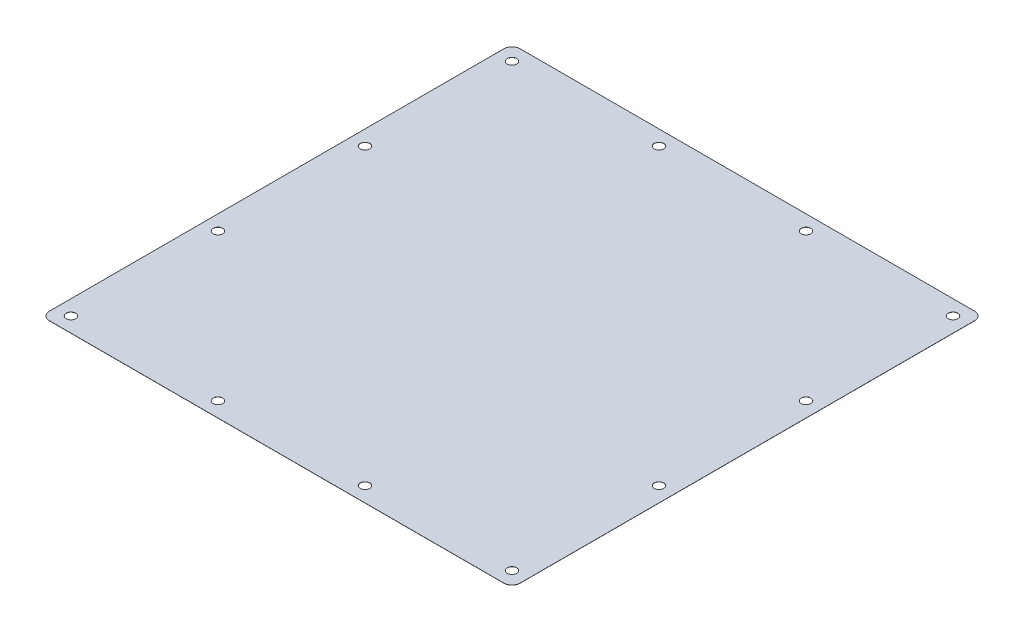
ISO-10303-21;
HEADER;
FILE_DESCRIPTION(('STEP AP214'),'2;1');
FILE_NAME('part.step','',(''),(''),'','','');
FILE_SCHEMA(('AUTOMOTIVE_DESIGN { 1 0 10303 214 1 1 1 1 }'));
ENDSEC;
DATA;
#1=APPLICATION_CONTEXT('core data for automotive mechanical design processes');
#2=APPLICATION_PROTOCOL_DEFINITION('international standard','automotive_design',2000,#1);
#3=PRODUCT_CONTEXT('',#1,'mechanical');
#4=PRODUCT('Part','Part','',(#3));
#5=PRODUCT_RELATED_PRODUCT_CATEGORY('part','',(#4));
#6=PRODUCT_DEFINITION_FORMATION('','',#4);
#7=PRODUCT_DEFINITION_CONTEXT('part definition',#1,'design');
#8=PRODUCT_DEFINITION('design','',#6,#7);
#9=PRODUCT_DEFINITION_SHAPE('','',#8);
#10=(LENGTH_UNIT() NAMED_UNIT(*) SI_UNIT(.MILLI.,.METRE.));
#11=(NAMED_UNIT(*) PLANE_ANGLE_UNIT() SI_UNIT($,.RADIAN.));
#12=(NAMED_UNIT(*) SI_UNIT($,.STERADIAN.) SOLID_ANGLE_UNIT());
#13=UNCERTAINTY_MEASURE_WITH_UNIT(LENGTH_MEASURE(1.E-05),#10,'distance_accuracy_value','');
#14=(GEOMETRIC_REPRESENTATION_CONTEXT(3) GLOBAL_UNCERTAINTY_ASSIGNED_CONTEXT((#13)) GLOBAL_UNIT_ASSIGNED_CONTEXT((#10,
#11,#12)) REPRESENTATION_CONTEXT('',''));
#15=CARTESIAN_POINT('',(0.,0.,0.));
#16=DIRECTION('',(0.,0.,1.));
#17=DIRECTION('',(1.,0.,0.));
#18=AXIS2_PLACEMENT_3D('',#15,#16,#17);
#19=CARTESIAN_POINT('',(177.038,-0.0508,-3.175));
#20=DIRECTION('',(0.,1.,0.));
#21=DIRECTION('',(0.,0.,1.));
#22=AXIS2_PLACEMENT_3D('',#19,#20,#21);
#23=CYLINDRICAL_SURFACE('',#22,3.17500000000001);
#24=CARTESIAN_POINT('',(177.038,0.,-3.175));
#25=DIRECTION('',(0.,1.,0.));
#26=DIRECTION('',(0.,0.,-1.));
#27=AXIS2_PLACEMENT_3D('',#24,#25,#26);
#28=CIRCLE('',#27,3.17500000000001);
#29=CARTESIAN_POINT('',(177.038,0.,0.));
#30=VERTEX_POINT('',#29);
#31=CARTESIAN_POINT('',(180.213,0.,-3.175));
#32=VERTEX_POINT('',#31);
#33=EDGE_CURVE('E138',#30,#32,#28,.T.);
#34=ORIENTED_EDGE('',*,*,#33,.F.);
#35=DIRECTION('',(0.,1.,0.));
#36=VECTOR('',#35,1.);
#37=CARTESIAN_POINT('',(177.038,-0.0508,0.));
#38=LINE('',#37,#36);
#39=CARTESIAN_POINT('',(177.038,-0.0508,0.));
#40=VERTEX_POINT('',#39);
#41=EDGE_CURVE('E11',#40,#30,#38,.T.);
#42=ORIENTED_EDGE('',*,*,#41,.F.);
#43=CARTESIAN_POINT('',(177.038,-0.0508,-3.175));
#44=DIRECTION('',(0.,1.,0.));
#45=DIRECTION('',(0.,0.,-1.));
#46=AXIS2_PLACEMENT_3D('',#43,#44,#45);
#47=CIRCLE('',#46,3.17500000000001);
#48=CARTESIAN_POINT('',(180.213,-0.0508,-3.175));
#49=VERTEX_POINT('',#48);
#50=EDGE_CURVE('E159',#40,#49,#47,.T.);
#51=ORIENTED_EDGE('',*,*,#50,.T.);
#52=DIRECTION('',(0.,1.,0.));
#53=VECTOR('',#52,1.);
#54=CARTESIAN_POINT('',(180.213,-0.0508,-3.175));
#55=LINE('',#54,#53);
#56=EDGE_CURVE('E44',#49,#32,#55,.T.);
#57=ORIENTED_EDGE('',*,*,#56,.T.);
#58=EDGE_LOOP('',(#34,#42,#51,#57));
#59=FACE_BOUND('',#58,.T.);
#60=ADVANCED_FACE('F41',(#59),#23,.T.);
#61=CARTESIAN_POINT('',(3.17500000000002,-0.0508,0.));
#62=DIRECTION('',(0.,0.,1.));
#63=DIRECTION('',(1.,0.,0.));
#64=AXIS2_PLACEMENT_3D('',#61,#62,#63);
#65=PLANE('',#64);
#66=DIRECTION('',(1.,0.,0.));
#67=VECTOR('',#66,1.);
#68=CARTESIAN_POINT('',(3.17500000000002,0.,0.));
#69=LINE('',#68,#67);
#70=CARTESIAN_POINT('',(3.17500000000002,0.,0.));
#71=VERTEX_POINT('',#70);
#72=EDGE_CURVE('E157',#71,#30,#69,.T.);
#73=ORIENTED_EDGE('',*,*,#72,.F.);
#74=DIRECTION('',(0.,1.,0.));
#75=VECTOR('',#74,1.);
#76=CARTESIAN_POINT('',(3.17500000000002,-0.0508,0.));
#77=LINE('',#76,#75);
#78=CARTESIAN_POINT('',(3.17500000000002,-0.0508,0.));
#79=VERTEX_POINT('',#78);
#80=EDGE_CURVE('E50',#79,#71,#77,.T.);
#81=ORIENTED_EDGE('',*,*,#80,.F.);
#82=DIRECTION('',(1.,0.,0.));
#83=VECTOR('',#82,1.);
#84=CARTESIAN_POINT('',(3.17500000000002,-0.0508,0.));
#85=LINE('',#84,#83);
#86=EDGE_CURVE('E128',#79,#40,#85,.T.);
#87=ORIENTED_EDGE('',*,*,#86,.T.);
#88=ORIENTED_EDGE('',*,*,#41,.T.);
#89=EDGE_LOOP('',(#73,#81,#87,#88));
#90=FACE_BOUND('',#89,.T.);
#91=ADVANCED_FACE('F171',(#90),#65,.T.);
#92=CARTESIAN_POINT('',(3.175,-0.0508,-3.175));
#93=DIRECTION('',(0.,1.,0.));
#94=DIRECTION('',(0.,0.,1.));
#95=AXIS2_PLACEMENT_3D('',#92,#93,#94);
#96=CYLINDRICAL_SURFACE('',#95,3.175);
#97=CARTESIAN_POINT('',(3.175,0.,-3.175));
#98=DIRECTION('',(0.,1.,0.));
#99=DIRECTION('',(0.,0.,-1.));
#100=AXIS2_PLACEMENT_3D('',#97,#98,#99);
#101=CIRCLE('',#100,3.175);
#102=CARTESIAN_POINT('',(0.,0.,-3.17500000000002));
#103=VERTEX_POINT('',#102);
#104=EDGE_CURVE('E115',#103,#71,#101,.T.);
#105=ORIENTED_EDGE('',*,*,#104,.F.);
#106=DIRECTION('',(0.,1.,0.));
#107=VECTOR('',#106,1.);
#108=CARTESIAN_POINT('',(0.,-0.0508,-3.17500000000002));
#109=LINE('',#108,#107);
#110=CARTESIAN_POINT('',(0.,-0.0508,-3.17500000000002));
#111=VERTEX_POINT('',#110);
#112=EDGE_CURVE('E110',#111,#103,#109,.T.);
#113=ORIENTED_EDGE('',*,*,#112,.F.);
#114=CARTESIAN_POINT('',(3.175,-0.0508,-3.175));
#115=DIRECTION('',(0.,1.,0.));
#116=DIRECTION('',(0.,0.,-1.));
#117=AXIS2_PLACEMENT_3D('',#114,#115,#116);
#118=CIRCLE('',#117,3.175);
#119=EDGE_CURVE('E113',#111,#79,#118,.T.);
#120=ORIENTED_EDGE('',*,*,#119,.T.);
#121=ORIENTED_EDGE('',*,*,#80,.T.);
#122=EDGE_LOOP('',(#105,#113,#120,#121));
#123=FACE_BOUND('',#122,.T.);
#124=ADVANCED_FACE('F112',(#123),#96,.T.);
#125=CARTESIAN_POINT('',(0.,-0.0508,-3.17500000000002));
#126=DIRECTION('',(-1.,0.,0.));
#127=DIRECTION('',(0.,0.,1.));
#128=AXIS2_PLACEMENT_3D('',#125,#126,#127);
#129=PLANE('',#128);
#130=DIRECTION('',(0.,0.,1.));
#131=VECTOR('',#130,1.);
#132=CARTESIAN_POINT('',(0.,0.,-3.17500000000002));
#133=LINE('',#132,#131);
#134=CARTESIAN_POINT('',(0.,0.,-177.038));
#135=VERTEX_POINT('',#134);
#136=EDGE_CURVE('E154',#135,#103,#133,.T.);
#137=ORIENTED_EDGE('',*,*,#136,.F.);
#138=DIRECTION('',(0.,1.,0.));
#139=VECTOR('',#138,1.);
#140=CARTESIAN_POINT('',(0.,-0.0508,-177.038));
#141=LINE('',#140,#139);
#142=CARTESIAN_POINT('',(0.,-0.0508,-177.038));
#143=VERTEX_POINT('',#142);
#144=EDGE_CURVE('E120',#143,#135,#141,.T.);
#145=ORIENTED_EDGE('',*,*,#144,.F.);
#146=DIRECTION('',(0.,0.,1.));
#147=VECTOR('',#146,1.);
#148=CARTESIAN_POINT('',(0.,-0.0508,-3.17500000000002));
#149=LINE('',#148,#147);
#150=EDGE_CURVE('E126',#143,#111,#149,.T.);
#151=ORIENTED_EDGE('',*,*,#150,.T.);
#152=ORIENTED_EDGE('',*,*,#112,.T.);
#153=EDGE_LOOP('',(#137,#145,#151,#152));
#154=FACE_BOUND('',#153,.T.);
#155=ADVANCED_FACE('F130',(#154),#129,.T.);
#156=CARTESIAN_POINT('',(3.175,-0.0508,-177.038));
#157=DIRECTION('',(0.,1.,0.));
#158=DIRECTION('',(0.,0.,1.));
#159=AXIS2_PLACEMENT_3D('',#156,#157,#158);
#160=CYLINDRICAL_SURFACE('',#159,3.17500000000001);
#161=CARTESIAN_POINT('',(3.175,0.,-177.038));
#162=DIRECTION('',(0.,1.,0.));
#163=DIRECTION('',(0.,0.,1.));
#164=AXIS2_PLACEMENT_3D('',#161,#162,#163);
#165=CIRCLE('',#164,3.17500000000001);
#166=CARTESIAN_POINT('',(3.175,0.,-180.213));
#167=VERTEX_POINT('',#166);
#168=EDGE_CURVE('E151',#167,#135,#165,.T.);
#169=ORIENTED_EDGE('',*,*,#168,.F.);
#170=DIRECTION('',(0.,1.,0.));
#171=VECTOR('',#170,1.);
#172=CARTESIAN_POINT('',(3.175,-0.0508,-180.213));
#173=LINE('',#172,#171);
#174=CARTESIAN_POINT('',(3.175,-0.0508,-180.213));
#175=VERTEX_POINT('',#174);
#176=EDGE_CURVE('E163',#175,#167,#173,.T.);
#177=ORIENTED_EDGE('',*,*,#176,.F.);
#178=CARTESIAN_POINT('',(3.175,-0.0508,-177.038));
#179=DIRECTION('',(0.,1.,0.));
#180=DIRECTION('',(0.,0.,1.));
#181=AXIS2_PLACEMENT_3D('',#178,#179,#180);
#182=CIRCLE('',#181,3.17500000000001);
#183=EDGE_CURVE('E131',#175,#143,#182,.T.);
#184=ORIENTED_EDGE('',*,*,#183,.T.);
#185=ORIENTED_EDGE('',*,*,#144,.T.);
#186=EDGE_LOOP('',(#169,#177,#184,#185));
#187=FACE_BOUND('',#186,.T.);
#188=ADVANCED_FACE('F184',(#187),#160,.T.);
#189=CARTESIAN_POINT('',(3.175,-0.0508,-180.213));
#190=DIRECTION('',(0.,0.,-1.));
#191=DIRECTION('',(-1.,0.,0.));
#192=AXIS2_PLACEMENT_3D('',#189,#190,#191);
#193=PLANE('',#192);
#194=DIRECTION('',(-1.,0.,0.));
#195=VECTOR('',#194,1.);
#196=CARTESIAN_POINT('',(3.175,0.,-180.213));
#197=LINE('',#196,#195);
#198=CARTESIAN_POINT('',(177.038,0.,-180.213));
#199=VERTEX_POINT('',#198);
#200=EDGE_CURVE('E148',#199,#167,#197,.T.);
#201=ORIENTED_EDGE('',*,*,#200,.F.);
#202=DIRECTION('',(0.,1.,0.));
#203=VECTOR('',#202,1.);
#204=CARTESIAN_POINT('',(177.038,-0.0508,-180.213));
#205=LINE('',#204,#203);
#206=CARTESIAN_POINT('',(177.038,-0.0508,-180.213));
#207=VERTEX_POINT('',#206);
#208=EDGE_CURVE('E165',#207,#199,#205,.T.);
#209=ORIENTED_EDGE('',*,*,#208,.F.);
#210=DIRECTION('',(-1.,0.,0.));
#211=VECTOR('',#210,1.);
#212=CARTESIAN_POINT('',(3.175,-0.0508,-180.213));
#213=LINE('',#212,#211);
#214=EDGE_CURVE('E133',#207,#175,#213,.T.);
#215=ORIENTED_EDGE('',*,*,#214,.T.);
#216=ORIENTED_EDGE('',*,*,#176,.T.);
#217=EDGE_LOOP('',(#201,#209,#215,#216));
#218=FACE_BOUND('',#217,.T.);
#219=ADVANCED_FACE('F187',(#218),#193,.T.);
#220=CARTESIAN_POINT('',(177.038,-0.0508,-177.038));
#221=DIRECTION('',(0.,1.,0.));
#222=DIRECTION('',(0.,0.,1.));
#223=AXIS2_PLACEMENT_3D('',#220,#221,#222);
#224=CYLINDRICAL_SURFACE('',#223,3.17500000000001);
#225=CARTESIAN_POINT('',(177.038,0.,-177.038));
#226=DIRECTION('',(0.,1.,0.));
#227=DIRECTION('',(0.,0.,1.));
#228=AXIS2_PLACEMENT_3D('',#225,#226,#227);
#229=CIRCLE('',#228,3.17500000000001);
#230=CARTESIAN_POINT('',(180.213,0.,-177.038));
#231=VERTEX_POINT('',#230);
#232=EDGE_CURVE('E145',#231,#199,#229,.T.);
#233=ORIENTED_EDGE('',*,*,#232,.F.);
#234=DIRECTION('',(0.,1.,0.));
#235=VECTOR('',#234,1.);
#236=CARTESIAN_POINT('',(180.213,-0.0508,-177.038));
#237=LINE('',#236,#235);
#238=CARTESIAN_POINT('',(180.213,-0.0508,-177.038));
#239=VERTEX_POINT('',#238);
#240=EDGE_CURVE('E166',#239,#231,#237,.T.);
#241=ORIENTED_EDGE('',*,*,#240,.F.);
#242=CARTESIAN_POINT('',(177.038,-0.0508,-177.038));
#243=DIRECTION('',(0.,1.,0.));
#244=DIRECTION('',(0.,0.,1.));
#245=AXIS2_PLACEMENT_3D('',#242,#243,#244);
#246=CIRCLE('',#245,3.17500000000001);
#247=EDGE_CURVE('E333',#239,#207,#246,.T.);
#248=ORIENTED_EDGE('',*,*,#247,.T.);
#249=ORIENTED_EDGE('',*,*,#208,.T.);
#250=EDGE_LOOP('',(#233,#241,#248,#249));
#251=FACE_BOUND('',#250,.T.);
#252=ADVANCED_FACE('F191',(#251),#224,.T.);
#253=CARTESIAN_POINT('',(180.213,-0.0508,-3.175));
#254=DIRECTION('',(1.,0.,0.));
#255=DIRECTION('',(0.,0.,-1.));
#256=AXIS2_PLACEMENT_3D('',#253,#254,#255);
#257=PLANE('',#256);
#258=DIRECTION('',(0.,0.,-1.));
#259=VECTOR('',#258,1.);
#260=CARTESIAN_POINT('',(180.213,0.,-3.175));
#261=LINE('',#260,#259);
#262=EDGE_CURVE('E141',#32,#231,#261,.T.);
#263=ORIENTED_EDGE('',*,*,#262,.F.);
#264=ORIENTED_EDGE('',*,*,#56,.F.);
#265=DIRECTION('',(0.,0.,-1.));
#266=VECTOR('',#265,1.);
#267=CARTESIAN_POINT('',(180.213,-0.0508,-3.175));
#268=LINE('',#267,#266);
#269=EDGE_CURVE('E331',#49,#239,#268,.T.);
#270=ORIENTED_EDGE('',*,*,#269,.T.);
#271=ORIENTED_EDGE('',*,*,#240,.T.);
#272=EDGE_LOOP('',(#263,#264,#270,#271));
#273=FACE_BOUND('',#272,.T.);
#274=ADVANCED_FACE('F168',(#273),#257,.T.);
#275=CARTESIAN_POINT('',(177.038,-0.0508,-3.175));
#276=DIRECTION('',(0.,-1.,0.));
#277=DIRECTION('',(0.,0.,-1.));
#278=AXIS2_PLACEMENT_3D('',#275,#276,#277);
#279=PLANE('',#278);
#280=CARTESIAN_POINT('',(118.237,-0.0507999999999997,-5.71500000000005));
#281=DIRECTION('',(0.,1.,0.));
#282=DIRECTION('',(0.,0.,1.));
#283=AXIS2_PLACEMENT_3D('',#280,#281,#282);
#284=CIRCLE('',#283,1.82880000000001);
#285=CARTESIAN_POINT('',(118.237,-0.0507999999999997,-3.88620000000004));
#286=VERTEX_POINT('',#285);
#287=EDGE_CURVE('E258',#286,#286,#284,.T.);
#288=ORIENTED_EDGE('',*,*,#287,.T.);
#289=EDGE_LOOP('',(#288));
#290=FACE_BOUND('',#289,.T.);
#291=CARTESIAN_POINT('',(174.498,-0.0507999999999997,-5.71500000000005));
#292=DIRECTION('',(0.,1.,0.));
#293=DIRECTION('',(0.,0.,1.));
#294=AXIS2_PLACEMENT_3D('',#291,#292,#293);
#295=CIRCLE('',#294,1.82879999999999);
#296=CARTESIAN_POINT('',(174.498,-0.0507999999999997,-3.88620000000006));
#297=VERTEX_POINT('',#296);
#298=EDGE_CURVE('E268',#297,#297,#295,.T.);
#299=ORIENTED_EDGE('',*,*,#298,.T.);
#300=EDGE_LOOP('',(#299));
#301=FACE_BOUND('',#300,.T.);
#302=CARTESIAN_POINT('',(174.498,-0.0507999999999997,-61.976));
#303=DIRECTION('',(0.,1.,0.));
#304=DIRECTION('',(0.,0.,1.));
#305=AXIS2_PLACEMENT_3D('',#302,#303,#304);
#306=CIRCLE('',#305,1.82879999999999);
#307=CARTESIAN_POINT('',(174.498,-0.0507999999999997,-60.1472000000001));
#308=VERTEX_POINT('',#307);
#309=EDGE_CURVE('E274',#308,#308,#306,.T.);
#310=ORIENTED_EDGE('',*,*,#309,.T.);
#311=EDGE_LOOP('',(#310));
#312=FACE_BOUND('',#311,.T.);
#313=CARTESIAN_POINT('',(174.498,-0.0507999999999997,-118.237));
#314=DIRECTION('',(0.,1.,0.));
#315=DIRECTION('',(0.,0.,1.));
#316=AXIS2_PLACEMENT_3D('',#313,#314,#315);
#317=CIRCLE('',#316,1.82879999999999);
#318=CARTESIAN_POINT('',(174.498,-0.0507999999999997,-116.4082));
#319=VERTEX_POINT('',#318);
#320=EDGE_CURVE('E280',#319,#319,#317,.T.);
#321=ORIENTED_EDGE('',*,*,#320,.T.);
#322=EDGE_LOOP('',(#321));
#323=FACE_BOUND('',#322,.T.);
#324=CARTESIAN_POINT('',(174.498,-0.0507999999999997,-174.498));
#325=DIRECTION('',(0.,1.,0.));
#326=DIRECTION('',(0.,0.,1.));
#327=AXIS2_PLACEMENT_3D('',#324,#325,#326);
#328=CIRCLE('',#327,1.82879999999999);
#329=CARTESIAN_POINT('',(174.498,-0.0507999999999997,-172.6692));
#330=VERTEX_POINT('',#329);
#331=EDGE_CURVE('E286',#330,#330,#328,.T.);
#332=ORIENTED_EDGE('',*,*,#331,.T.);
#333=EDGE_LOOP('',(#332));
#334=FACE_BOUND('',#333,.T.);
#335=CARTESIAN_POINT('',(118.237,-0.0507999999999997,-174.498));
#336=DIRECTION('',(0.,1.,0.));
#337=DIRECTION('',(0.,0.,1.));
#338=AXIS2_PLACEMENT_3D('',#335,#336,#337);
#339=CIRCLE('',#338,1.82880000000001);
#340=CARTESIAN_POINT('',(118.237,-0.0507999999999997,-172.6692));
#341=VERTEX_POINT('',#340);
#342=EDGE_CURVE('E292',#341,#341,#339,.T.);
#343=ORIENTED_EDGE('',*,*,#342,.T.);
#344=EDGE_LOOP('',(#343));
#345=FACE_BOUND('',#344,.T.);
#346=CARTESIAN_POINT('',(61.976,-0.0507999999999997,-174.498));
#347=DIRECTION('',(0.,1.,0.));
#348=DIRECTION('',(0.,0.,1.));
#349=AXIS2_PLACEMENT_3D('',#346,#347,#348);
#350=CIRCLE('',#349,1.82880000000001);
#351=CARTESIAN_POINT('',(61.976,-0.0507999999999997,-172.6692));
#352=VERTEX_POINT('',#351);
#353=EDGE_CURVE('E298',#352,#352,#350,.T.);
#354=ORIENTED_EDGE('',*,*,#353,.T.);
#355=EDGE_LOOP('',(#354));
#356=FACE_BOUND('',#355,.T.);
#357=CARTESIAN_POINT('',(5.715,-0.0507999999999997,-174.498));
#358=DIRECTION('',(0.,1.,0.));
#359=DIRECTION('',(0.,0.,1.));
#360=AXIS2_PLACEMENT_3D('',#357,#358,#359);
#361=CIRCLE('',#360,1.8288);
#362=CARTESIAN_POINT('',(5.715,-0.0507999999999997,-172.6692));
#363=VERTEX_POINT('',#362);
#364=EDGE_CURVE('E304',#363,#363,#361,.T.);
#365=ORIENTED_EDGE('',*,*,#364,.T.);
#366=EDGE_LOOP('',(#365));
#367=FACE_BOUND('',#366,.T.);
#368=CARTESIAN_POINT('',(5.715,-0.0507999999999997,-118.237));
#369=DIRECTION('',(0.,1.,0.));
#370=DIRECTION('',(0.,0.,1.));
#371=AXIS2_PLACEMENT_3D('',#368,#369,#370);
#372=CIRCLE('',#371,1.8288);
#373=CARTESIAN_POINT('',(5.715,-0.0507999999999997,-116.4082));
#374=VERTEX_POINT('',#373);
#375=EDGE_CURVE('E310',#374,#374,#372,.T.);
#376=ORIENTED_EDGE('',*,*,#375,.T.);
#377=EDGE_LOOP('',(#376));
#378=FACE_BOUND('',#377,.T.);
#379=CARTESIAN_POINT('',(5.715,-0.0507999999999997,-61.976));
#380=DIRECTION('',(0.,1.,0.));
#381=DIRECTION('',(0.,0.,1.));
#382=AXIS2_PLACEMENT_3D('',#379,#380,#381);
#383=CIRCLE('',#382,1.8288);
#384=CARTESIAN_POINT('',(5.715,-0.0507999999999997,-60.1472));
#385=VERTEX_POINT('',#384);
#386=EDGE_CURVE('E316',#385,#385,#383,.T.);
#387=ORIENTED_EDGE('',*,*,#386,.T.);
#388=EDGE_LOOP('',(#387));
#389=FACE_BOUND('',#388,.T.);
#390=CARTESIAN_POINT('',(5.715,-0.0507999999999997,-5.71500000000005));
#391=DIRECTION('',(0.,1.,0.));
#392=DIRECTION('',(0.,0.,1.));
#393=AXIS2_PLACEMENT_3D('',#390,#391,#392);
#394=CIRCLE('',#393,1.8288);
#395=CARTESIAN_POINT('',(5.715,-0.0507999999999997,-3.88620000000006));
#396=VERTEX_POINT('',#395);
#397=EDGE_CURVE('E322',#396,#396,#394,.T.);
#398=ORIENTED_EDGE('',*,*,#397,.T.);
#399=EDGE_LOOP('',(#398));
#400=FACE_BOUND('',#399,.T.);
#401=CARTESIAN_POINT('',(61.976,-0.0507999999999997,-5.71500000000005));
#402=DIRECTION('',(0.,1.,0.));
#403=DIRECTION('',(0.,0.,1.));
#404=AXIS2_PLACEMENT_3D('',#401,#402,#403);
#405=CIRCLE('',#404,1.82880000000001);
#406=CARTESIAN_POINT('',(61.976,-0.0507999999999997,-3.88620000000004));
#407=VERTEX_POINT('',#406);
#408=EDGE_CURVE('E142',#407,#407,#405,.T.);
#409=ORIENTED_EDGE('',*,*,#408,.T.);
#410=EDGE_LOOP('',(#409));
#411=FACE_BOUND('',#410,.T.);
#412=ORIENTED_EDGE('',*,*,#50,.F.);
#413=ORIENTED_EDGE('',*,*,#86,.F.);
#414=ORIENTED_EDGE('',*,*,#119,.F.);
#415=ORIENTED_EDGE('',*,*,#150,.F.);
#416=ORIENTED_EDGE('',*,*,#183,.F.);
#417=ORIENTED_EDGE('',*,*,#214,.F.);
#418=ORIENTED_EDGE('',*,*,#247,.F.);
#419=ORIENTED_EDGE('',*,*,#269,.F.);
#420=EDGE_LOOP('',(#412,#413,#414,#415,#416,#417,#418,#419));
#421=FACE_BOUND('',#420,.T.);
#422=ADVANCED_FACE('F124',(#290,#301,#312,#323,#334,#345,#356,#367,#378,#389,#400,#411,#421),
#279,.T.);
#423=CARTESIAN_POINT('',(177.038,0.,-3.175));
#424=DIRECTION('',(0.,-1.,0.));
#425=DIRECTION('',(0.,0.,-1.));
#426=AXIS2_PLACEMENT_3D('',#423,#424,#425);
#427=PLANE('',#426);
#428=CARTESIAN_POINT('',(118.237,0.,-5.71500000000005));
#429=DIRECTION('',(0.,1.,0.));
#430=DIRECTION('',(0.,0.,1.));
#431=AXIS2_PLACEMENT_3D('',#428,#429,#430);
#432=CIRCLE('',#431,1.82879999999999);
#433=CARTESIAN_POINT('',(118.237,0.,-3.88620000000006));
#434=VERTEX_POINT('',#433);
#435=EDGE_CURVE('E261',#434,#434,#432,.T.);
#436=ORIENTED_EDGE('',*,*,#435,.F.);
#437=EDGE_LOOP('',(#436));
#438=FACE_BOUND('',#437,.T.);
#439=CARTESIAN_POINT('',(174.498,0.,-5.71500000000005));
#440=DIRECTION('',(0.,1.,0.));
#441=DIRECTION('',(0.,0.,1.));
#442=AXIS2_PLACEMENT_3D('',#439,#440,#441);
#443=CIRCLE('',#442,1.82879999999999);
#444=CARTESIAN_POINT('',(174.498,0.,-3.88620000000006));
#445=VERTEX_POINT('',#444);
#446=EDGE_CURVE('E263',#445,#445,#443,.T.);
#447=ORIENTED_EDGE('',*,*,#446,.F.);
#448=EDGE_LOOP('',(#447));
#449=FACE_BOUND('',#448,.T.);
#450=CARTESIAN_POINT('',(174.498,0.,-61.976));
#451=DIRECTION('',(0.,1.,0.));
#452=DIRECTION('',(0.,0.,1.));
#453=AXIS2_PLACEMENT_3D('',#450,#451,#452);
#454=CIRCLE('',#453,1.82879999999999);
#455=CARTESIAN_POINT('',(174.498,0.,-60.1472000000001));
#456=VERTEX_POINT('',#455);
#457=EDGE_CURVE('E271',#456,#456,#454,.T.);
#458=ORIENTED_EDGE('',*,*,#457,.F.);
#459=EDGE_LOOP('',(#458));
#460=FACE_BOUND('',#459,.T.);
#461=CARTESIAN_POINT('',(174.498,0.,-118.237));
#462=DIRECTION('',(0.,1.,0.));
#463=DIRECTION('',(0.,0.,1.));
#464=AXIS2_PLACEMENT_3D('',#461,#462,#463);
#465=CIRCLE('',#464,1.82879999999999);
#466=CARTESIAN_POINT('',(174.498,0.,-116.4082));
#467=VERTEX_POINT('',#466);
#468=EDGE_CURVE('E277',#467,#467,#465,.T.);
#469=ORIENTED_EDGE('',*,*,#468,.F.);
#470=EDGE_LOOP('',(#469));
#471=FACE_BOUND('',#470,.T.);
#472=CARTESIAN_POINT('',(174.498,0.,-174.498));
#473=DIRECTION('',(0.,1.,0.));
#474=DIRECTION('',(0.,0.,1.));
#475=AXIS2_PLACEMENT_3D('',#472,#473,#474);
#476=CIRCLE('',#475,1.82879999999999);
#477=CARTESIAN_POINT('',(174.498,0.,-172.6692));
#478=VERTEX_POINT('',#477);
#479=EDGE_CURVE('E283',#478,#478,#476,.T.);
#480=ORIENTED_EDGE('',*,*,#479,.F.);
#481=EDGE_LOOP('',(#480));
#482=FACE_BOUND('',#481,.T.);
#483=CARTESIAN_POINT('',(118.237,0.,-174.498));
#484=DIRECTION('',(0.,1.,0.));
#485=DIRECTION('',(0.,0.,1.));
#486=AXIS2_PLACEMENT_3D('',#483,#484,#485);
#487=CIRCLE('',#486,1.82879999999999);
#488=CARTESIAN_POINT('',(118.237,0.,-172.6692));
#489=VERTEX_POINT('',#488);
#490=EDGE_CURVE('E289',#489,#489,#487,.T.);
#491=ORIENTED_EDGE('',*,*,#490,.F.);
#492=EDGE_LOOP('',(#491));
#493=FACE_BOUND('',#492,.T.);
#494=CARTESIAN_POINT('',(61.976,0.,-174.498));
#495=DIRECTION('',(0.,1.,0.));
#496=DIRECTION('',(0.,0.,1.));
#497=AXIS2_PLACEMENT_3D('',#494,#495,#496);
#498=CIRCLE('',#497,1.82879999999999);
#499=CARTESIAN_POINT('',(61.976,0.,-172.6692));
#500=VERTEX_POINT('',#499);
#501=EDGE_CURVE('E295',#500,#500,#498,.T.);
#502=ORIENTED_EDGE('',*,*,#501,.F.);
#503=EDGE_LOOP('',(#502));
#504=FACE_BOUND('',#503,.T.);
#505=CARTESIAN_POINT('',(5.715,0.,-174.498));
#506=DIRECTION('',(0.,1.,0.));
#507=DIRECTION('',(0.,0.,1.));
#508=AXIS2_PLACEMENT_3D('',#505,#506,#507);
#509=CIRCLE('',#508,1.82879999999999);
#510=CARTESIAN_POINT('',(5.715,0.,-172.6692));
#511=VERTEX_POINT('',#510);
#512=EDGE_CURVE('E301',#511,#511,#509,.T.);
#513=ORIENTED_EDGE('',*,*,#512,.F.);
#514=EDGE_LOOP('',(#513));
#515=FACE_BOUND('',#514,.T.);
#516=CARTESIAN_POINT('',(5.715,0.,-118.237));
#517=DIRECTION('',(0.,1.,0.));
#518=DIRECTION('',(0.,0.,1.));
#519=AXIS2_PLACEMENT_3D('',#516,#517,#518);
#520=CIRCLE('',#519,1.82879999999999);
#521=CARTESIAN_POINT('',(5.715,0.,-116.4082));
#522=VERTEX_POINT('',#521);
#523=EDGE_CURVE('E307',#522,#522,#520,.T.);
#524=ORIENTED_EDGE('',*,*,#523,.F.);
#525=EDGE_LOOP('',(#524));
#526=FACE_BOUND('',#525,.T.);
#527=CARTESIAN_POINT('',(5.715,0.,-61.976));
#528=DIRECTION('',(0.,1.,0.));
#529=DIRECTION('',(0.,0.,1.));
#530=AXIS2_PLACEMENT_3D('',#527,#528,#529);
#531=CIRCLE('',#530,1.82879999999999);
#532=CARTESIAN_POINT('',(5.715,0.,-60.1472000000001));
#533=VERTEX_POINT('',#532);
#534=EDGE_CURVE('E313',#533,#533,#531,.T.);
#535=ORIENTED_EDGE('',*,*,#534,.F.);
#536=EDGE_LOOP('',(#535));
#537=FACE_BOUND('',#536,.T.);
#538=CARTESIAN_POINT('',(5.715,0.,-5.71500000000005));
#539=DIRECTION('',(0.,1.,0.));
#540=DIRECTION('',(0.,0.,1.));
#541=AXIS2_PLACEMENT_3D('',#538,#539,#540);
#542=CIRCLE('',#541,1.82879999999999);
#543=CARTESIAN_POINT('',(5.715,0.,-3.88620000000007));
#544=VERTEX_POINT('',#543);
#545=EDGE_CURVE('E319',#544,#544,#542,.T.);
#546=ORIENTED_EDGE('',*,*,#545,.F.);
#547=EDGE_LOOP('',(#546));
#548=FACE_BOUND('',#547,.T.);
#549=CARTESIAN_POINT('',(61.976,0.,-5.71500000000005));
#550=DIRECTION('',(0.,1.,0.));
#551=DIRECTION('',(0.,0.,1.));
#552=AXIS2_PLACEMENT_3D('',#549,#550,#551);
#553=CIRCLE('',#552,1.82879999999999);
#554=CARTESIAN_POINT('',(61.976,0.,-3.88620000000006));
#555=VERTEX_POINT('',#554);
#556=EDGE_CURVE('E325',#555,#555,#553,.T.);
#557=ORIENTED_EDGE('',*,*,#556,.F.);
#558=EDGE_LOOP('',(#557));
#559=FACE_BOUND('',#558,.T.);
#560=ORIENTED_EDGE('',*,*,#33,.T.);
#561=ORIENTED_EDGE('',*,*,#262,.T.);
#562=ORIENTED_EDGE('',*,*,#232,.T.);
#563=ORIENTED_EDGE('',*,*,#200,.T.);
#564=ORIENTED_EDGE('',*,*,#168,.T.);
#565=ORIENTED_EDGE('',*,*,#136,.T.);
#566=ORIENTED_EDGE('',*,*,#104,.T.);
#567=ORIENTED_EDGE('',*,*,#72,.T.);
#568=EDGE_LOOP('',(#560,#561,#562,#563,#564,#565,#566,#567));
#569=FACE_BOUND('',#568,.T.);
#570=ADVANCED_FACE('F170',(#438,#449,#460,#471,#482,#493,#504,#515,#526,#537,#548,#559,#569),
#427,.F.);
#571=CARTESIAN_POINT('',(61.976,0.,-5.71500000000005));
#572=DIRECTION('',(0.,1.,0.));
#573=DIRECTION('',(0.,0.,1.));
#574=AXIS2_PLACEMENT_3D('',#571,#572,#573);
#575=CYLINDRICAL_SURFACE('',#574,1.8288);
#576=ORIENTED_EDGE('',*,*,#408,.F.);
#577=EDGE_LOOP('',(#576));
#578=FACE_BOUND('',#577,.T.);
#579=ORIENTED_EDGE('',*,*,#556,.T.);
#580=EDGE_LOOP('',(#579));
#581=FACE_BOUND('',#580,.T.);
#582=ADVANCED_FACE('F203',(#578,#581),#575,.F.);
#583=CARTESIAN_POINT('',(5.715,0.,-5.71500000000005));
#584=DIRECTION('',(0.,1.,0.));
#585=DIRECTION('',(0.,0.,1.));
#586=AXIS2_PLACEMENT_3D('',#583,#584,#585);
#587=CYLINDRICAL_SURFACE('',#586,1.82879999999999);
#588=ORIENTED_EDGE('',*,*,#397,.F.);
#589=EDGE_LOOP('',(#588));
#590=FACE_BOUND('',#589,.T.);
#591=ORIENTED_EDGE('',*,*,#545,.T.);
#592=EDGE_LOOP('',(#591));
#593=FACE_BOUND('',#592,.T.);
#594=ADVANCED_FACE('F210',(#590,#593),#587,.F.);
#595=CARTESIAN_POINT('',(5.715,0.,-61.976));
#596=DIRECTION('',(0.,1.,0.));
#597=DIRECTION('',(0.,0.,1.));
#598=AXIS2_PLACEMENT_3D('',#595,#596,#597);
#599=CYLINDRICAL_SURFACE('',#598,1.82879999999999);
#600=ORIENTED_EDGE('',*,*,#386,.F.);
#601=EDGE_LOOP('',(#600));
#602=FACE_BOUND('',#601,.T.);
#603=ORIENTED_EDGE('',*,*,#534,.T.);
#604=EDGE_LOOP('',(#603));
#605=FACE_BOUND('',#604,.T.);
#606=ADVANCED_FACE('F214',(#602,#605),#599,.F.);
#607=CARTESIAN_POINT('',(5.715,0.,-118.237));
#608=DIRECTION('',(0.,1.,0.));
#609=DIRECTION('',(0.,0.,1.));
#610=AXIS2_PLACEMENT_3D('',#607,#608,#609);
#611=CYLINDRICAL_SURFACE('',#610,1.82879999999999);
#612=ORIENTED_EDGE('',*,*,#375,.F.);
#613=EDGE_LOOP('',(#612));
#614=FACE_BOUND('',#613,.T.);
#615=ORIENTED_EDGE('',*,*,#523,.T.);
#616=EDGE_LOOP('',(#615));
#617=FACE_BOUND('',#616,.T.);
#618=ADVANCED_FACE('F218',(#614,#617),#611,.F.);
#619=CARTESIAN_POINT('',(5.715,0.,-174.498));
#620=DIRECTION('',(0.,1.,0.));
#621=DIRECTION('',(0.,0.,1.));
#622=AXIS2_PLACEMENT_3D('',#619,#620,#621);
#623=CYLINDRICAL_SURFACE('',#622,1.82879999999999);
#624=ORIENTED_EDGE('',*,*,#364,.F.);
#625=EDGE_LOOP('',(#624));
#626=FACE_BOUND('',#625,.T.);
#627=ORIENTED_EDGE('',*,*,#512,.T.);
#628=EDGE_LOOP('',(#627));
#629=FACE_BOUND('',#628,.T.);
#630=ADVANCED_FACE('F222',(#626,#629),#623,.F.);
#631=CARTESIAN_POINT('',(61.976,0.,-174.498));
#632=DIRECTION('',(0.,1.,0.));
#633=DIRECTION('',(0.,0.,1.));
#634=AXIS2_PLACEMENT_3D('',#631,#632,#633);
#635=CYLINDRICAL_SURFACE('',#634,1.8288);
#636=ORIENTED_EDGE('',*,*,#353,.F.);
#637=EDGE_LOOP('',(#636));
#638=FACE_BOUND('',#637,.T.);
#639=ORIENTED_EDGE('',*,*,#501,.T.);
#640=EDGE_LOOP('',(#639));
#641=FACE_BOUND('',#640,.T.);
#642=ADVANCED_FACE('F226',(#638,#641),#635,.F.);
#643=CARTESIAN_POINT('',(118.237,0.,-174.498));
#644=DIRECTION('',(0.,1.,0.));
#645=DIRECTION('',(0.,0.,1.));
#646=AXIS2_PLACEMENT_3D('',#643,#644,#645);
#647=CYLINDRICAL_SURFACE('',#646,1.8288);
#648=ORIENTED_EDGE('',*,*,#342,.F.);
#649=EDGE_LOOP('',(#648));
#650=FACE_BOUND('',#649,.T.);
#651=ORIENTED_EDGE('',*,*,#490,.T.);
#652=EDGE_LOOP('',(#651));
#653=FACE_BOUND('',#652,.T.);
#654=ADVANCED_FACE('F230',(#650,#653),#647,.F.);
#655=CARTESIAN_POINT('',(174.498,0.,-174.498));
#656=DIRECTION('',(0.,1.,0.));
#657=DIRECTION('',(0.,0.,1.));
#658=AXIS2_PLACEMENT_3D('',#655,#656,#657);
#659=CYLINDRICAL_SURFACE('',#658,1.82879999999999);
#660=ORIENTED_EDGE('',*,*,#331,.F.);
#661=EDGE_LOOP('',(#660));
#662=FACE_BOUND('',#661,.T.);
#663=ORIENTED_EDGE('',*,*,#479,.T.);
#664=EDGE_LOOP('',(#663));
#665=FACE_BOUND('',#664,.T.);
#666=ADVANCED_FACE('F234',(#662,#665),#659,.F.);
#667=CARTESIAN_POINT('',(174.498,0.,-118.237));
#668=DIRECTION('',(0.,1.,0.));
#669=DIRECTION('',(0.,0.,1.));
#670=AXIS2_PLACEMENT_3D('',#667,#668,#669);
#671=CYLINDRICAL_SURFACE('',#670,1.82879999999999);
#672=ORIENTED_EDGE('',*,*,#320,.F.);
#673=EDGE_LOOP('',(#672));
#674=FACE_BOUND('',#673,.T.);
#675=ORIENTED_EDGE('',*,*,#468,.T.);
#676=EDGE_LOOP('',(#675));
#677=FACE_BOUND('',#676,.T.);
#678=ADVANCED_FACE('F238',(#674,#677),#671,.F.);
#679=CARTESIAN_POINT('',(174.498,0.,-61.976));
#680=DIRECTION('',(0.,1.,0.));
#681=DIRECTION('',(0.,0.,1.));
#682=AXIS2_PLACEMENT_3D('',#679,#680,#681);
#683=CYLINDRICAL_SURFACE('',#682,1.82879999999999);
#684=ORIENTED_EDGE('',*,*,#309,.F.);
#685=EDGE_LOOP('',(#684));
#686=FACE_BOUND('',#685,.T.);
#687=ORIENTED_EDGE('',*,*,#457,.T.);
#688=EDGE_LOOP('',(#687));
#689=FACE_BOUND('',#688,.T.);
#690=ADVANCED_FACE('F242',(#686,#689),#683,.F.);
#691=CARTESIAN_POINT('',(174.498,0.,-5.71500000000005));
#692=DIRECTION('',(0.,1.,0.));
#693=DIRECTION('',(0.,0.,1.));
#694=AXIS2_PLACEMENT_3D('',#691,#692,#693);
#695=CYLINDRICAL_SURFACE('',#694,1.82879999999999);
#696=ORIENTED_EDGE('',*,*,#298,.F.);
#697=EDGE_LOOP('',(#696));
#698=FACE_BOUND('',#697,.T.);
#699=ORIENTED_EDGE('',*,*,#446,.T.);
#700=EDGE_LOOP('',(#699));
#701=FACE_BOUND('',#700,.T.);
#702=ADVANCED_FACE('F246',(#698,#701),#695,.F.);
#703=CARTESIAN_POINT('',(118.237,0.,-5.71500000000005));
#704=DIRECTION('',(0.,1.,0.));
#705=DIRECTION('',(0.,0.,1.));
#706=AXIS2_PLACEMENT_3D('',#703,#704,#705);
#707=CYLINDRICAL_SURFACE('',#706,1.8288);
#708=ORIENTED_EDGE('',*,*,#287,.F.);
#709=EDGE_LOOP('',(#708));
#710=FACE_BOUND('',#709,.T.);
#711=ORIENTED_EDGE('',*,*,#435,.T.);
#712=EDGE_LOOP('',(#711));
#713=FACE_BOUND('',#712,.T.);
#714=ADVANCED_FACE('F250',(#710,#713),#707,.F.);
#715=CLOSED_SHELL('',(#60,#91,#124,#155,#188,#219,#252,#274,#422,#570,#582,#594,#606,#618,#630,
#642,#654,#666,#678,#690,#702,#714));
#716=MANIFOLD_SOLID_BREP('B2',#715);
#717=ADVANCED_BREP_SHAPE_REPRESENTATION('',(#18,#716),#14);
#718=SHAPE_DEFINITION_REPRESENTATION(#9,#717);
ENDSEC;
END-ISO-10303-21;
